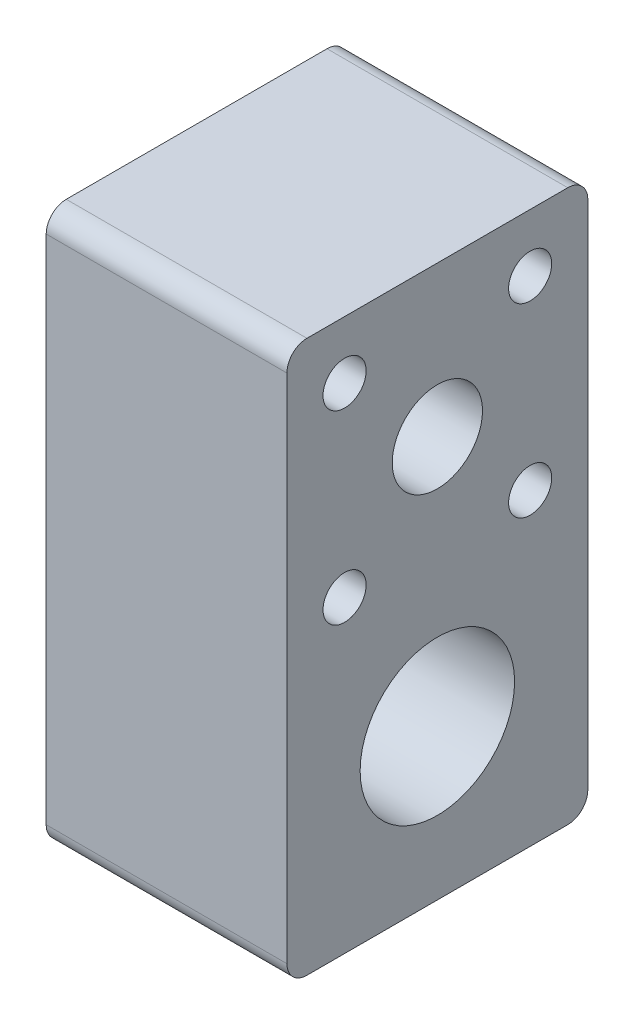
ISO-10303-21;
HEADER;
FILE_DESCRIPTION(('STEP AP214'),'2;1');
FILE_NAME('part.step','',(''),(''),'','','');
FILE_SCHEMA(('AUTOMOTIVE_DESIGN { 1 0 10303 214 1 1 1 1 }'));
ENDSEC;
DATA;
#1=APPLICATION_CONTEXT('core data for automotive mechanical design processes');
#2=APPLICATION_PROTOCOL_DEFINITION('international standard','automotive_design',2000,#1);
#3=PRODUCT_CONTEXT('',#1,'mechanical');
#4=PRODUCT('Part','Part','',(#3));
#5=PRODUCT_RELATED_PRODUCT_CATEGORY('part','',(#4));
#6=PRODUCT_DEFINITION_FORMATION('','',#4);
#7=PRODUCT_DEFINITION_CONTEXT('part definition',#1,'design');
#8=PRODUCT_DEFINITION('design','',#6,#7);
#9=PRODUCT_DEFINITION_SHAPE('','',#8);
#10=(LENGTH_UNIT() NAMED_UNIT(*) SI_UNIT(.MILLI.,.METRE.));
#11=(NAMED_UNIT(*) PLANE_ANGLE_UNIT() SI_UNIT($,.RADIAN.));
#12=(NAMED_UNIT(*) SI_UNIT($,.STERADIAN.) SOLID_ANGLE_UNIT());
#13=UNCERTAINTY_MEASURE_WITH_UNIT(LENGTH_MEASURE(1.E-05),#10,'distance_accuracy_value','');
#14=(GEOMETRIC_REPRESENTATION_CONTEXT(3) GLOBAL_UNCERTAINTY_ASSIGNED_CONTEXT((#13)) GLOBAL_UNIT_ASSIGNED_CONTEXT((#10,
#11,#12)) REPRESENTATION_CONTEXT('',''));
#15=CARTESIAN_POINT('',(0.,0.,0.));
#16=DIRECTION('',(0.,0.,1.));
#17=DIRECTION('',(1.,0.,0.));
#18=AXIS2_PLACEMENT_3D('',#15,#16,#17);
#19=CARTESIAN_POINT('',(12.,0.,0.));
#20=DIRECTION('',(-1.,0.,0.));
#21=DIRECTION('',(0.,0.,1.));
#22=AXIS2_PLACEMENT_3D('',#19,#20,#21);
#23=PLANE('',#22);
#24=CARTESIAN_POINT('',(12.,15.75,9.24999999999999));
#25=DIRECTION('',(1.,0.,0.));
#26=DIRECTION('',(0.,0.,-1.));
#27=AXIS2_PLACEMENT_3D('',#24,#25,#26);
#28=CIRCLE('',#27,2.15);
#29=CARTESIAN_POINT('',(12.,15.75,7.1));
#30=VERTEX_POINT('',#29);
#31=EDGE_CURVE('E196',#30,#30,#28,.T.);
#32=ORIENTED_EDGE('',*,*,#31,.F.);
#33=EDGE_LOOP('',(#32));
#34=FACE_BOUND('',#33,.T.);
#35=CARTESIAN_POINT('',(12.,34.25,-9.25));
#36=DIRECTION('',(1.,0.,0.));
#37=DIRECTION('',(0.,0.,-1.));
#38=AXIS2_PLACEMENT_3D('',#35,#36,#37);
#39=CIRCLE('',#38,2.15);
#40=CARTESIAN_POINT('',(12.,34.25,-11.4));
#41=VERTEX_POINT('',#40);
#42=EDGE_CURVE('E189',#41,#41,#39,.T.);
#43=ORIENTED_EDGE('',*,*,#42,.F.);
#44=EDGE_LOOP('',(#43));
#45=FACE_BOUND('',#44,.T.);
#46=CARTESIAN_POINT('',(12.,15.75,-9.25000000000001));
#47=DIRECTION('',(1.,0.,0.));
#48=DIRECTION('',(0.,0.,-1.));
#49=AXIS2_PLACEMENT_3D('',#46,#47,#48);
#50=CIRCLE('',#49,2.15);
#51=CARTESIAN_POINT('',(12.,15.75,-11.4));
#52=VERTEX_POINT('',#51);
#53=EDGE_CURVE('E201',#52,#52,#50,.T.);
#54=ORIENTED_EDGE('',*,*,#53,.F.);
#55=EDGE_LOOP('',(#54));
#56=FACE_BOUND('',#55,.T.);
#57=CARTESIAN_POINT('',(12.,34.25,9.25));
#58=DIRECTION('',(1.,0.,0.));
#59=DIRECTION('',(0.,0.,-1.));
#60=AXIS2_PLACEMENT_3D('',#57,#58,#59);
#61=CIRCLE('',#60,2.15);
#62=CARTESIAN_POINT('',(12.,34.25,7.1));
#63=VERTEX_POINT('',#62);
#64=EDGE_CURVE('E183',#63,#63,#61,.T.);
#65=ORIENTED_EDGE('',*,*,#64,.F.);
#66=EDGE_LOOP('',(#65));
#67=FACE_BOUND('',#66,.T.);
#68=DIRECTION('',(0.,0.,1.));
#69=VECTOR('',#68,1.);
#70=CARTESIAN_POINT('',(12.,40.,15.));
#71=LINE('',#70,#69);
#72=CARTESIAN_POINT('',(12.,40.,-13.));
#73=VERTEX_POINT('',#72);
#74=CARTESIAN_POINT('',(12.,40.,13.));
#75=VERTEX_POINT('',#74);
#76=EDGE_CURVE('E133',#73,#75,#71,.T.);
#77=ORIENTED_EDGE('',*,*,#76,.T.);
#78=CARTESIAN_POINT('',(12.,38.,13.));
#79=DIRECTION('',(-1.,0.,0.));
#80=DIRECTION('',(0.,0.,1.));
#81=AXIS2_PLACEMENT_3D('',#78,#79,#80);
#82=CIRCLE('',#81,2.);
#83=CARTESIAN_POINT('',(12.,38.,15.));
#84=VERTEX_POINT('',#83);
#85=EDGE_CURVE('E147',#75,#84,#82,.F.);
#86=ORIENTED_EDGE('',*,*,#85,.T.);
#87=DIRECTION('',(0.,-1.,0.));
#88=VECTOR('',#87,1.);
#89=CARTESIAN_POINT('',(12.,10.,15.));
#90=LINE('',#89,#88);
#91=CARTESIAN_POINT('',(12.,-13.,15.));
#92=VERTEX_POINT('',#91);
#93=EDGE_CURVE('E118',#84,#92,#90,.T.);
#94=ORIENTED_EDGE('',*,*,#93,.T.);
#95=CARTESIAN_POINT('',(12.,-13.,13.));
#96=DIRECTION('',(-1.,0.,0.));
#97=DIRECTION('',(0.,0.,1.));
#98=AXIS2_PLACEMENT_3D('',#95,#96,#97);
#99=CIRCLE('',#98,2.);
#100=CARTESIAN_POINT('',(12.,-15.,13.));
#101=VERTEX_POINT('',#100);
#102=EDGE_CURVE('E142',#92,#101,#99,.F.);
#103=ORIENTED_EDGE('',*,*,#102,.T.);
#104=DIRECTION('',(0.,0.,-1.));
#105=VECTOR('',#104,1.);
#106=CARTESIAN_POINT('',(12.,-15.,-15.));
#107=LINE('',#106,#105);
#108=CARTESIAN_POINT('',(12.,-15.,-13.));
#109=VERTEX_POINT('',#108);
#110=EDGE_CURVE('E127',#101,#109,#107,.T.);
#111=ORIENTED_EDGE('',*,*,#110,.T.);
#112=CARTESIAN_POINT('',(12.,-13.,-13.));
#113=DIRECTION('',(-1.,0.,0.));
#114=DIRECTION('',(0.,0.,1.));
#115=AXIS2_PLACEMENT_3D('',#112,#113,#114);
#116=CIRCLE('',#115,2.);
#117=CARTESIAN_POINT('',(12.,-13.,-15.));
#118=VERTEX_POINT('',#117);
#119=EDGE_CURVE('E54',#109,#118,#116,.F.);
#120=ORIENTED_EDGE('',*,*,#119,.T.);
#121=DIRECTION('',(0.,1.,0.));
#122=VECTOR('',#121,1.);
#123=CARTESIAN_POINT('',(12.,10.,-15.));
#124=LINE('',#123,#122);
#125=CARTESIAN_POINT('',(12.,38.,-15.));
#126=VERTEX_POINT('',#125);
#127=EDGE_CURVE('E171',#118,#126,#124,.T.);
#128=ORIENTED_EDGE('',*,*,#127,.T.);
#129=CARTESIAN_POINT('',(12.,38.,-13.));
#130=DIRECTION('',(-1.,0.,0.));
#131=DIRECTION('',(0.,0.,1.));
#132=AXIS2_PLACEMENT_3D('',#129,#130,#131);
#133=CIRCLE('',#132,2.);
#134=EDGE_CURVE('E145',#126,#73,#133,.F.);
#135=ORIENTED_EDGE('',*,*,#134,.T.);
#136=EDGE_LOOP('',(#77,#86,#94,#103,#111,#120,#128,#135));
#137=FACE_BOUND('',#136,.T.);
#138=CARTESIAN_POINT('',(12.,0.,0.));
#139=DIRECTION('',(1.,0.,0.));
#140=DIRECTION('',(0.,0.,-1.));
#141=AXIS2_PLACEMENT_3D('',#138,#139,#140);
#142=CIRCLE('',#141,7.7);
#143=CARTESIAN_POINT('',(12.,0.,-7.7));
#144=VERTEX_POINT('',#143);
#145=EDGE_CURVE('E163',#144,#144,#142,.T.);
#146=ORIENTED_EDGE('',*,*,#145,.F.);
#147=EDGE_LOOP('',(#146));
#148=FACE_BOUND('',#147,.T.);
#149=CARTESIAN_POINT('',(12.,25.,0.));
#150=DIRECTION('',(1.,0.,0.));
#151=DIRECTION('',(0.,0.,-1.));
#152=AXIS2_PLACEMENT_3D('',#149,#150,#151);
#153=CIRCLE('',#152,4.5);
#154=CARTESIAN_POINT('',(12.,25.,-4.5));
#155=VERTEX_POINT('',#154);
#156=EDGE_CURVE('E175',#155,#155,#153,.T.);
#157=ORIENTED_EDGE('',*,*,#156,.F.);
#158=EDGE_LOOP('',(#157));
#159=FACE_BOUND('',#158,.T.);
#160=ADVANCED_FACE('F32',(#34,#45,#56,#67,#137,#148,#159),#23,.F.);
#161=CARTESIAN_POINT('',(-12.,0.,0.));
#162=DIRECTION('',(-1.,0.,0.));
#163=DIRECTION('',(0.,0.,1.));
#164=AXIS2_PLACEMENT_3D('',#161,#162,#163);
#165=PLANE('',#164);
#166=CARTESIAN_POINT('',(-12.,15.75,9.24999999999999));
#167=DIRECTION('',(1.,0.,0.));
#168=DIRECTION('',(0.,0.,-1.));
#169=AXIS2_PLACEMENT_3D('',#166,#167,#168);
#170=CIRCLE('',#169,2.15);
#171=CARTESIAN_POINT('',(-12.,15.75,7.1));
#172=VERTEX_POINT('',#171);
#173=EDGE_CURVE('E186',#172,#172,#170,.T.);
#174=ORIENTED_EDGE('',*,*,#173,.T.);
#175=EDGE_LOOP('',(#174));
#176=FACE_BOUND('',#175,.T.);
#177=CARTESIAN_POINT('',(-12.,34.25,-9.25));
#178=DIRECTION('',(1.,0.,0.));
#179=DIRECTION('',(0.,0.,-1.));
#180=AXIS2_PLACEMENT_3D('',#177,#178,#179);
#181=CIRCLE('',#180,2.15);
#182=CARTESIAN_POINT('',(-12.,34.25,-11.4));
#183=VERTEX_POINT('',#182);
#184=EDGE_CURVE('E192',#183,#183,#181,.T.);
#185=ORIENTED_EDGE('',*,*,#184,.T.);
#186=EDGE_LOOP('',(#185));
#187=FACE_BOUND('',#186,.T.);
#188=CARTESIAN_POINT('',(-12.,15.75,-9.25000000000001));
#189=DIRECTION('',(1.,0.,0.));
#190=DIRECTION('',(0.,0.,-1.));
#191=AXIS2_PLACEMENT_3D('',#188,#189,#190);
#192=CIRCLE('',#191,2.15);
#193=CARTESIAN_POINT('',(-12.,15.75,-11.4));
#194=VERTEX_POINT('',#193);
#195=EDGE_CURVE('E193',#194,#194,#192,.T.);
#196=ORIENTED_EDGE('',*,*,#195,.T.);
#197=EDGE_LOOP('',(#196));
#198=FACE_BOUND('',#197,.T.);
#199=CARTESIAN_POINT('',(-12.,34.25,9.25));
#200=DIRECTION('',(1.,0.,0.));
#201=DIRECTION('',(0.,0.,-1.));
#202=AXIS2_PLACEMENT_3D('',#199,#200,#201);
#203=CIRCLE('',#202,2.15);
#204=CARTESIAN_POINT('',(-12.,34.25,7.1));
#205=VERTEX_POINT('',#204);
#206=EDGE_CURVE('E180',#205,#205,#203,.T.);
#207=ORIENTED_EDGE('',*,*,#206,.T.);
#208=EDGE_LOOP('',(#207));
#209=FACE_BOUND('',#208,.T.);
#210=CARTESIAN_POINT('',(-12.,0.,0.));
#211=DIRECTION('',(1.,0.,0.));
#212=DIRECTION('',(0.,0.,-1.));
#213=AXIS2_PLACEMENT_3D('',#210,#211,#212);
#214=CIRCLE('',#213,7.7);
#215=CARTESIAN_POINT('',(-12.,0.,-7.7));
#216=VERTEX_POINT('',#215);
#217=EDGE_CURVE('E166',#216,#216,#214,.T.);
#218=ORIENTED_EDGE('',*,*,#217,.T.);
#219=EDGE_LOOP('',(#218));
#220=FACE_BOUND('',#219,.T.);
#221=DIRECTION('',(0.,-1.,0.));
#222=VECTOR('',#221,1.);
#223=CARTESIAN_POINT('',(-12.,10.,15.));
#224=LINE('',#223,#222);
#225=CARTESIAN_POINT('',(-12.,38.,15.));
#226=VERTEX_POINT('',#225);
#227=CARTESIAN_POINT('',(-12.,-13.,15.));
#228=VERTEX_POINT('',#227);
#229=EDGE_CURVE('E115',#226,#228,#224,.T.);
#230=ORIENTED_EDGE('',*,*,#229,.F.);
#231=CARTESIAN_POINT('',(-12.,38.,13.));
#232=DIRECTION('',(-1.,0.,0.));
#233=DIRECTION('',(0.,0.,1.));
#234=AXIS2_PLACEMENT_3D('',#231,#232,#233);
#235=CIRCLE('',#234,2.);
#236=CARTESIAN_POINT('',(-12.,40.,13.));
#237=VERTEX_POINT('',#236);
#238=EDGE_CURVE('E98',#226,#237,#235,.T.);
#239=ORIENTED_EDGE('',*,*,#238,.T.);
#240=DIRECTION('',(0.,0.,1.));
#241=VECTOR('',#240,1.);
#242=CARTESIAN_POINT('',(-12.,40.,15.));
#243=LINE('',#242,#241);
#244=CARTESIAN_POINT('',(-12.,40.,-13.));
#245=VERTEX_POINT('',#244);
#246=EDGE_CURVE('E125',#245,#237,#243,.T.);
#247=ORIENTED_EDGE('',*,*,#246,.F.);
#248=CARTESIAN_POINT('',(-12.,38.,-13.));
#249=DIRECTION('',(-1.,0.,0.));
#250=DIRECTION('',(0.,0.,1.));
#251=AXIS2_PLACEMENT_3D('',#248,#249,#250);
#252=CIRCLE('',#251,2.);
#253=CARTESIAN_POINT('',(-12.,38.,-15.));
#254=VERTEX_POINT('',#253);
#255=EDGE_CURVE('E109',#245,#254,#252,.T.);
#256=ORIENTED_EDGE('',*,*,#255,.T.);
#257=DIRECTION('',(0.,1.,0.));
#258=VECTOR('',#257,1.);
#259=CARTESIAN_POINT('',(-12.,10.,-15.));
#260=LINE('',#259,#258);
#261=CARTESIAN_POINT('',(-12.,-13.,-15.));
#262=VERTEX_POINT('',#261);
#263=EDGE_CURVE('E129',#262,#254,#260,.T.);
#264=ORIENTED_EDGE('',*,*,#263,.F.);
#265=CARTESIAN_POINT('',(-12.,-13.,-13.));
#266=DIRECTION('',(-1.,0.,0.));
#267=DIRECTION('',(0.,0.,1.));
#268=AXIS2_PLACEMENT_3D('',#265,#266,#267);
#269=CIRCLE('',#268,2.);
#270=CARTESIAN_POINT('',(-12.,-15.,-13.));
#271=VERTEX_POINT('',#270);
#272=EDGE_CURVE('E136',#262,#271,#269,.T.);
#273=ORIENTED_EDGE('',*,*,#272,.T.);
#274=DIRECTION('',(0.,0.,-1.));
#275=VECTOR('',#274,1.);
#276=CARTESIAN_POINT('',(-12.,-15.,-15.));
#277=LINE('',#276,#275);
#278=CARTESIAN_POINT('',(-12.,-15.,13.));
#279=VERTEX_POINT('',#278);
#280=EDGE_CURVE('E158',#279,#271,#277,.T.);
#281=ORIENTED_EDGE('',*,*,#280,.F.);
#282=CARTESIAN_POINT('',(-12.,-13.,13.));
#283=DIRECTION('',(-1.,0.,0.));
#284=DIRECTION('',(0.,0.,1.));
#285=AXIS2_PLACEMENT_3D('',#282,#283,#284);
#286=CIRCLE('',#285,2.);
#287=EDGE_CURVE('E119',#279,#228,#286,.T.);
#288=ORIENTED_EDGE('',*,*,#287,.T.);
#289=EDGE_LOOP('',(#230,#239,#247,#256,#264,#273,#281,#288));
#290=FACE_BOUND('',#289,.T.);
#291=CARTESIAN_POINT('',(-12.,25.,0.));
#292=DIRECTION('',(1.,0.,0.));
#293=DIRECTION('',(0.,0.,-1.));
#294=AXIS2_PLACEMENT_3D('',#291,#292,#293);
#295=CIRCLE('',#294,4.5);
#296=CARTESIAN_POINT('',(-12.,25.,-4.5));
#297=VERTEX_POINT('',#296);
#298=EDGE_CURVE('E177',#297,#297,#295,.T.);
#299=ORIENTED_EDGE('',*,*,#298,.T.);
#300=EDGE_LOOP('',(#299));
#301=FACE_BOUND('',#300,.T.);
#302=ADVANCED_FACE('F122',(#176,#187,#198,#209,#220,#290,#301),#165,.T.);
#303=CARTESIAN_POINT('',(12.,-15.,-15.));
#304=DIRECTION('',(0.,1.,0.));
#305=DIRECTION('',(0.,0.,1.));
#306=AXIS2_PLACEMENT_3D('',#303,#304,#305);
#307=PLANE('',#306);
#308=ORIENTED_EDGE('',*,*,#280,.T.);
#309=DIRECTION('',(-1.,0.,0.));
#310=VECTOR('',#309,1.);
#311=CARTESIAN_POINT('',(12.,-15.,-13.));
#312=LINE('',#311,#310);
#313=EDGE_CURVE('E11',#271,#109,#312,.F.);
#314=ORIENTED_EDGE('',*,*,#313,.T.);
#315=ORIENTED_EDGE('',*,*,#110,.F.);
#316=DIRECTION('',(-1.,0.,0.));
#317=VECTOR('',#316,1.);
#318=CARTESIAN_POINT('',(12.,-15.,13.));
#319=LINE('',#318,#317);
#320=EDGE_CURVE('E40',#101,#279,#319,.T.);
#321=ORIENTED_EDGE('',*,*,#320,.T.);
#322=EDGE_LOOP('',(#308,#314,#315,#321));
#323=FACE_BOUND('',#322,.T.);
#324=ADVANCED_FACE('F157',(#323),#307,.F.);
#325=CARTESIAN_POINT('',(12.,10.,-15.));
#326=DIRECTION('',(0.,0.,1.));
#327=DIRECTION('',(1.,0.,0.));
#328=AXIS2_PLACEMENT_3D('',#325,#326,#327);
#329=PLANE('',#328);
#330=ORIENTED_EDGE('',*,*,#263,.T.);
#331=DIRECTION('',(-1.,0.,0.));
#332=VECTOR('',#331,1.);
#333=CARTESIAN_POINT('',(12.,38.,-15.));
#334=LINE('',#333,#332);
#335=EDGE_CURVE('E47',#254,#126,#334,.F.);
#336=ORIENTED_EDGE('',*,*,#335,.T.);
#337=ORIENTED_EDGE('',*,*,#127,.F.);
#338=DIRECTION('',(-1.,0.,0.));
#339=VECTOR('',#338,1.);
#340=CARTESIAN_POINT('',(12.,-13.,-15.));
#341=LINE('',#340,#339);
#342=EDGE_CURVE('E149',#118,#262,#341,.T.);
#343=ORIENTED_EDGE('',*,*,#342,.T.);
#344=EDGE_LOOP('',(#330,#336,#337,#343));
#345=FACE_BOUND('',#344,.T.);
#346=ADVANCED_FACE('F240',(#345),#329,.F.);
#347=CARTESIAN_POINT('',(12.,40.,15.));
#348=DIRECTION('',(0.,-1.,0.));
#349=DIRECTION('',(0.,0.,-1.));
#350=AXIS2_PLACEMENT_3D('',#347,#348,#349);
#351=PLANE('',#350);
#352=ORIENTED_EDGE('',*,*,#246,.T.);
#353=DIRECTION('',(-1.,0.,0.));
#354=VECTOR('',#353,1.);
#355=CARTESIAN_POINT('',(12.,40.,13.));
#356=LINE('',#355,#354);
#357=EDGE_CURVE('E103',#237,#75,#356,.F.);
#358=ORIENTED_EDGE('',*,*,#357,.T.);
#359=ORIENTED_EDGE('',*,*,#76,.F.);
#360=DIRECTION('',(-1.,0.,0.));
#361=VECTOR('',#360,1.);
#362=CARTESIAN_POINT('',(12.,40.,-13.));
#363=LINE('',#362,#361);
#364=EDGE_CURVE('E108',#73,#245,#363,.T.);
#365=ORIENTED_EDGE('',*,*,#364,.T.);
#366=EDGE_LOOP('',(#352,#358,#359,#365));
#367=FACE_BOUND('',#366,.T.);
#368=ADVANCED_FACE('F247',(#367),#351,.F.);
#369=CARTESIAN_POINT('',(12.,10.,15.));
#370=DIRECTION('',(0.,0.,-1.));
#371=DIRECTION('',(-1.,0.,0.));
#372=AXIS2_PLACEMENT_3D('',#369,#370,#371);
#373=PLANE('',#372);
#374=ORIENTED_EDGE('',*,*,#93,.F.);
#375=DIRECTION('',(-1.,0.,0.));
#376=VECTOR('',#375,1.);
#377=CARTESIAN_POINT('',(12.,38.,15.));
#378=LINE('',#377,#376);
#379=EDGE_CURVE('E102',#84,#226,#378,.T.);
#380=ORIENTED_EDGE('',*,*,#379,.T.);
#381=ORIENTED_EDGE('',*,*,#229,.T.);
#382=DIRECTION('',(-1.,0.,0.));
#383=VECTOR('',#382,1.);
#384=CARTESIAN_POINT('',(12.,-13.,15.));
#385=LINE('',#384,#383);
#386=EDGE_CURVE('E120',#228,#92,#385,.F.);
#387=ORIENTED_EDGE('',*,*,#386,.T.);
#388=EDGE_LOOP('',(#374,#380,#381,#387));
#389=FACE_BOUND('',#388,.T.);
#390=ADVANCED_FACE('F114',(#389),#373,.F.);
#391=CARTESIAN_POINT('',(12.,0.,0.));
#392=DIRECTION('',(-1.,0.,0.));
#393=DIRECTION('',(0.,0.,1.));
#394=AXIS2_PLACEMENT_3D('',#391,#392,#393);
#395=CYLINDRICAL_SURFACE('',#394,7.7);
#396=ORIENTED_EDGE('',*,*,#145,.T.);
#397=EDGE_LOOP('',(#396));
#398=FACE_BOUND('',#397,.T.);
#399=ORIENTED_EDGE('',*,*,#217,.F.);
#400=EDGE_LOOP('',(#399));
#401=FACE_BOUND('',#400,.T.);
#402=ADVANCED_FACE('F231',(#398,#401),#395,.F.);
#403=CARTESIAN_POINT('',(12.,25.,0.));
#404=DIRECTION('',(-1.,0.,0.));
#405=DIRECTION('',(0.,0.,1.));
#406=AXIS2_PLACEMENT_3D('',#403,#404,#405);
#407=CYLINDRICAL_SURFACE('',#406,4.5);
#408=ORIENTED_EDGE('',*,*,#156,.T.);
#409=EDGE_LOOP('',(#408));
#410=FACE_BOUND('',#409,.T.);
#411=ORIENTED_EDGE('',*,*,#298,.F.);
#412=EDGE_LOOP('',(#411));
#413=FACE_BOUND('',#412,.T.);
#414=ADVANCED_FACE('F228',(#410,#413),#407,.F.);
#415=CARTESIAN_POINT('',(-12.,34.25,9.25));
#416=DIRECTION('',(1.,0.,0.));
#417=DIRECTION('',(0.,0.,-1.));
#418=AXIS2_PLACEMENT_3D('',#415,#416,#417);
#419=CYLINDRICAL_SURFACE('',#418,2.15);
#420=ORIENTED_EDGE('',*,*,#206,.F.);
#421=EDGE_LOOP('',(#420));
#422=FACE_BOUND('',#421,.T.);
#423=ORIENTED_EDGE('',*,*,#64,.T.);
#424=EDGE_LOOP('',(#423));
#425=FACE_BOUND('',#424,.T.);
#426=ADVANCED_FACE('F213',(#422,#425),#419,.F.);
#427=CARTESIAN_POINT('',(-12.,15.75,-9.25000000000001));
#428=DIRECTION('',(1.,0.,0.));
#429=DIRECTION('',(0.,0.,-1.));
#430=AXIS2_PLACEMENT_3D('',#427,#428,#429);
#431=CYLINDRICAL_SURFACE('',#430,2.15);
#432=ORIENTED_EDGE('',*,*,#195,.F.);
#433=EDGE_LOOP('',(#432));
#434=FACE_BOUND('',#433,.T.);
#435=ORIENTED_EDGE('',*,*,#53,.T.);
#436=EDGE_LOOP('',(#435));
#437=FACE_BOUND('',#436,.T.);
#438=ADVANCED_FACE('F209',(#434,#437),#431,.F.);
#439=CARTESIAN_POINT('',(-12.,34.25,-9.25));
#440=DIRECTION('',(1.,0.,0.));
#441=DIRECTION('',(0.,0.,-1.));
#442=AXIS2_PLACEMENT_3D('',#439,#440,#441);
#443=CYLINDRICAL_SURFACE('',#442,2.15);
#444=ORIENTED_EDGE('',*,*,#184,.F.);
#445=EDGE_LOOP('',(#444));
#446=FACE_BOUND('',#445,.T.);
#447=ORIENTED_EDGE('',*,*,#42,.T.);
#448=EDGE_LOOP('',(#447));
#449=FACE_BOUND('',#448,.T.);
#450=ADVANCED_FACE('F212',(#446,#449),#443,.F.);
#451=CARTESIAN_POINT('',(-12.,15.75,9.24999999999999));
#452=DIRECTION('',(1.,0.,0.));
#453=DIRECTION('',(0.,0.,-1.));
#454=AXIS2_PLACEMENT_3D('',#451,#452,#453);
#455=CYLINDRICAL_SURFACE('',#454,2.15);
#456=ORIENTED_EDGE('',*,*,#173,.F.);
#457=EDGE_LOOP('',(#456));
#458=FACE_BOUND('',#457,.T.);
#459=ORIENTED_EDGE('',*,*,#31,.T.);
#460=EDGE_LOOP('',(#459));
#461=FACE_BOUND('',#460,.T.);
#462=ADVANCED_FACE('F256',(#458,#461),#455,.F.);
#463=CARTESIAN_POINT('',(12.,38.,13.));
#464=DIRECTION('',(-1.,0.,0.));
#465=DIRECTION('',(0.,0.,1.));
#466=AXIS2_PLACEMENT_3D('',#463,#464,#465);
#467=CYLINDRICAL_SURFACE('',#466,2.);
#468=ORIENTED_EDGE('',*,*,#85,.F.);
#469=ORIENTED_EDGE('',*,*,#357,.F.);
#470=ORIENTED_EDGE('',*,*,#238,.F.);
#471=ORIENTED_EDGE('',*,*,#379,.F.);
#472=EDGE_LOOP('',(#468,#469,#470,#471));
#473=FACE_BOUND('',#472,.T.);
#474=ADVANCED_FACE('F101',(#473),#467,.T.);
#475=CARTESIAN_POINT('',(12.,38.,-13.));
#476=DIRECTION('',(-1.,0.,0.));
#477=DIRECTION('',(0.,0.,1.));
#478=AXIS2_PLACEMENT_3D('',#475,#476,#477);
#479=CYLINDRICAL_SURFACE('',#478,2.);
#480=ORIENTED_EDGE('',*,*,#134,.F.);
#481=ORIENTED_EDGE('',*,*,#335,.F.);
#482=ORIENTED_EDGE('',*,*,#255,.F.);
#483=ORIENTED_EDGE('',*,*,#364,.F.);
#484=EDGE_LOOP('',(#480,#481,#482,#483));
#485=FACE_BOUND('',#484,.T.);
#486=ADVANCED_FACE('F255',(#485),#479,.T.);
#487=CARTESIAN_POINT('',(12.,-13.,-13.));
#488=DIRECTION('',(-1.,0.,0.));
#489=DIRECTION('',(0.,0.,1.));
#490=AXIS2_PLACEMENT_3D('',#487,#488,#489);
#491=CYLINDRICAL_SURFACE('',#490,2.);
#492=ORIENTED_EDGE('',*,*,#119,.F.);
#493=ORIENTED_EDGE('',*,*,#313,.F.);
#494=ORIENTED_EDGE('',*,*,#272,.F.);
#495=ORIENTED_EDGE('',*,*,#342,.F.);
#496=EDGE_LOOP('',(#492,#493,#494,#495));
#497=FACE_BOUND('',#496,.T.);
#498=ADVANCED_FACE('F258',(#497),#491,.T.);
#499=CARTESIAN_POINT('',(12.,-13.,13.));
#500=DIRECTION('',(-1.,0.,0.));
#501=DIRECTION('',(0.,0.,1.));
#502=AXIS2_PLACEMENT_3D('',#499,#500,#501);
#503=CYLINDRICAL_SURFACE('',#502,2.);
#504=ORIENTED_EDGE('',*,*,#102,.F.);
#505=ORIENTED_EDGE('',*,*,#386,.F.);
#506=ORIENTED_EDGE('',*,*,#287,.F.);
#507=ORIENTED_EDGE('',*,*,#320,.F.);
#508=EDGE_LOOP('',(#504,#505,#506,#507));
#509=FACE_BOUND('',#508,.T.);
#510=ADVANCED_FACE('F34',(#509),#503,.T.);
#511=CLOSED_SHELL('',(#160,#302,#324,#346,#368,#390,#402,#414,#426,#438,#450,#462,#474,#486,
#498,#510));
#512=MANIFOLD_SOLID_BREP('B2',#511);
#513=ADVANCED_BREP_SHAPE_REPRESENTATION('',(#18,#512),#14);
#514=SHAPE_DEFINITION_REPRESENTATION(#9,#513);
ENDSEC;
END-ISO-10303-21;
